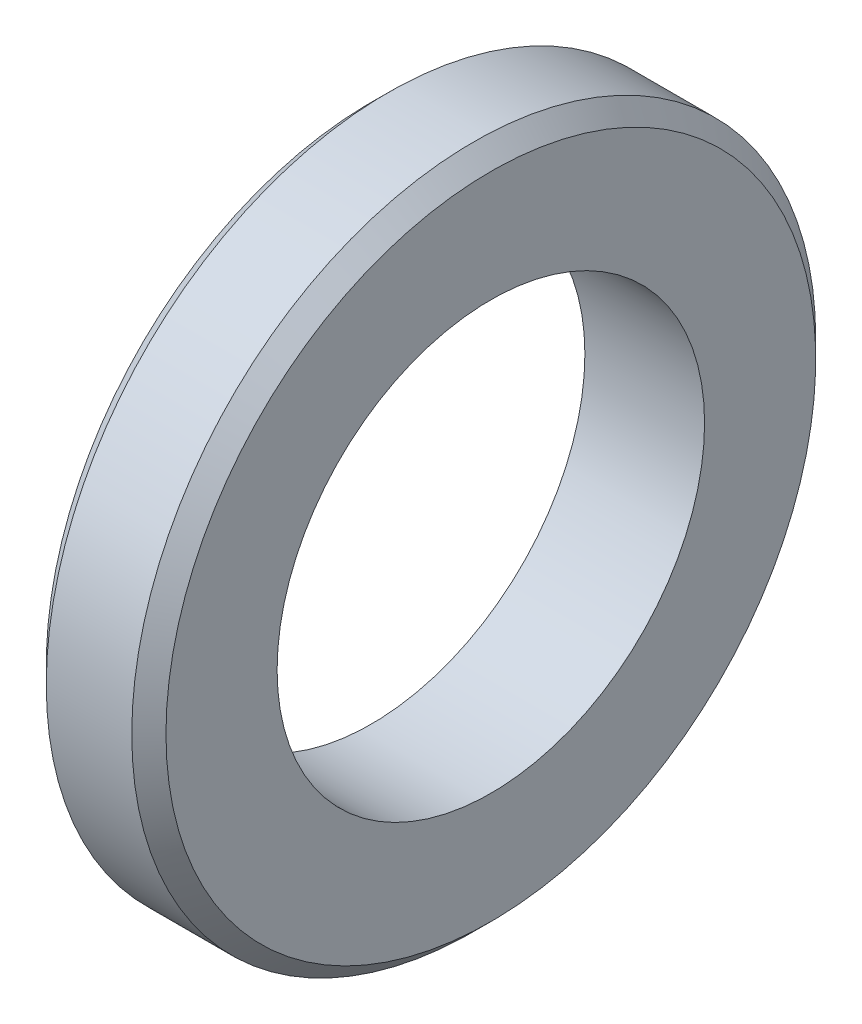
ISO-10303-21;
HEADER;
FILE_DESCRIPTION(('STEP AP214'),'2;1');
FILE_NAME('part.step','',(''),(''),'','','');
FILE_SCHEMA(('AUTOMOTIVE_DESIGN { 1 0 10303 214 1 1 1 1 }'));
ENDSEC;
DATA;
#1=APPLICATION_CONTEXT('core data for automotive mechanical design processes');
#2=APPLICATION_PROTOCOL_DEFINITION('international standard','automotive_design',2000,#1);
#3=PRODUCT_CONTEXT('',#1,'mechanical');
#4=PRODUCT('Part','Part','',(#3));
#5=PRODUCT_RELATED_PRODUCT_CATEGORY('part','',(#4));
#6=PRODUCT_DEFINITION_FORMATION('','',#4);
#7=PRODUCT_DEFINITION_CONTEXT('part definition',#1,'design');
#8=PRODUCT_DEFINITION('design','',#6,#7);
#9=PRODUCT_DEFINITION_SHAPE('','',#8);
#10=(LENGTH_UNIT() NAMED_UNIT(*) SI_UNIT(.MILLI.,.METRE.));
#11=(NAMED_UNIT(*) PLANE_ANGLE_UNIT() SI_UNIT($,.RADIAN.));
#12=(NAMED_UNIT(*) SI_UNIT($,.STERADIAN.) SOLID_ANGLE_UNIT());
#13=UNCERTAINTY_MEASURE_WITH_UNIT(LENGTH_MEASURE(1.E-05),#10,'distance_accuracy_value','');
#14=(GEOMETRIC_REPRESENTATION_CONTEXT(3) GLOBAL_UNCERTAINTY_ASSIGNED_CONTEXT((#13)) GLOBAL_UNIT_ASSIGNED_CONTEXT((#10,
#11,#12)) REPRESENTATION_CONTEXT('',''));
#15=CARTESIAN_POINT('',(0.,0.,0.));
#16=DIRECTION('',(0.,0.,1.));
#17=DIRECTION('',(1.,0.,0.));
#18=AXIS2_PLACEMENT_3D('',#15,#16,#17);
#19=CARTESIAN_POINT('',(1.4,4.,0.));
#20=DIRECTION('',(-1.,0.,0.));
#21=DIRECTION('',(0.,0.,1.));
#22=AXIS2_PLACEMENT_3D('',#19,#20,#21);
#23=PLANE('',#22);
#24=CARTESIAN_POINT('',(1.4,0.,0.));
#25=DIRECTION('',(-1.,0.,0.));
#26=DIRECTION('',(0.,0.,1.));
#27=AXIS2_PLACEMENT_3D('',#24,#25,#26);
#28=CIRCLE('',#27,3.8);
#29=CARTESIAN_POINT('',(1.4,0.,3.8));
#30=VERTEX_POINT('',#29);
#31=EDGE_CURVE('E10',#30,#30,#28,.F.);
#32=ORIENTED_EDGE('',*,*,#31,.T.);
#33=EDGE_LOOP('',(#32));
#34=FACE_BOUND('',#33,.T.);
#35=CARTESIAN_POINT('',(1.4,0.,0.));
#36=DIRECTION('',(-1.,0.,0.));
#37=DIRECTION('',(0.,0.,1.));
#38=AXIS2_PLACEMENT_3D('',#35,#36,#37);
#39=CIRCLE('',#38,2.5);
#40=CARTESIAN_POINT('',(1.4,0.,2.5));
#41=VERTEX_POINT('',#40);
#42=EDGE_CURVE('E51',#41,#41,#39,.T.);
#43=ORIENTED_EDGE('',*,*,#42,.T.);
#44=EDGE_LOOP('',(#43));
#45=FACE_BOUND('',#44,.T.);
#46=ADVANCED_FACE('F31',(#34,#45),#23,.F.);
#47=CARTESIAN_POINT('',(0.,0.,0.));
#48=DIRECTION('',(-1.,0.,0.));
#49=DIRECTION('',(0.,0.,1.));
#50=AXIS2_PLACEMENT_3D('',#47,#48,#49);
#51=CYLINDRICAL_SURFACE('',#50,2.5);
#52=ORIENTED_EDGE('',*,*,#42,.F.);
#53=EDGE_LOOP('',(#52));
#54=FACE_BOUND('',#53,.T.);
#55=CARTESIAN_POINT('',(0.,0.,0.));
#56=DIRECTION('',(-1.,0.,0.));
#57=DIRECTION('',(0.,0.,1.));
#58=AXIS2_PLACEMENT_3D('',#55,#56,#57);
#59=CIRCLE('',#58,2.5);
#60=CARTESIAN_POINT('',(0.,0.,2.5));
#61=VERTEX_POINT('',#60);
#62=EDGE_CURVE('E54',#61,#61,#59,.T.);
#63=ORIENTED_EDGE('',*,*,#62,.T.);
#64=EDGE_LOOP('',(#63));
#65=FACE_BOUND('',#64,.T.);
#66=ADVANCED_FACE('F58',(#54,#65),#51,.F.);
#67=CARTESIAN_POINT('',(0.,2.5,0.));
#68=DIRECTION('',(1.,0.,0.));
#69=DIRECTION('',(0.,0.,-1.));
#70=AXIS2_PLACEMENT_3D('',#67,#68,#69);
#71=PLANE('',#70);
#72=CARTESIAN_POINT('',(0.,0.,0.));
#73=DIRECTION('',(1.,0.,0.));
#74=DIRECTION('',(0.,0.,-1.));
#75=AXIS2_PLACEMENT_3D('',#72,#73,#74);
#76=CIRCLE('',#75,3.8);
#77=CARTESIAN_POINT('',(0.,0.,-3.8));
#78=VERTEX_POINT('',#77);
#79=EDGE_CURVE('E46',#78,#78,#76,.F.);
#80=ORIENTED_EDGE('',*,*,#79,.T.);
#81=EDGE_LOOP('',(#80));
#82=FACE_BOUND('',#81,.T.);
#83=ORIENTED_EDGE('',*,*,#62,.F.);
#84=EDGE_LOOP('',(#83));
#85=FACE_BOUND('',#84,.T.);
#86=ADVANCED_FACE('F60',(#82,#85),#71,.F.);
#87=CARTESIAN_POINT('',(0.,0.,0.));
#88=DIRECTION('',(-1.,0.,0.));
#89=DIRECTION('',(0.,0.,1.));
#90=AXIS2_PLACEMENT_3D('',#87,#88,#89);
#91=CYLINDRICAL_SURFACE('',#90,4.);
#92=CARTESIAN_POINT('',(0.200000000000002,0.,0.));
#93=DIRECTION('',(1.,0.,0.));
#94=DIRECTION('',(0.,0.,-1.));
#95=AXIS2_PLACEMENT_3D('',#92,#93,#94);
#96=CIRCLE('',#95,4.);
#97=CARTESIAN_POINT('',(0.200000000000002,0.,-4.));
#98=VERTEX_POINT('',#97);
#99=EDGE_CURVE('E38',#98,#98,#96,.T.);
#100=ORIENTED_EDGE('',*,*,#99,.T.);
#101=EDGE_LOOP('',(#100));
#102=FACE_BOUND('',#101,.T.);
#103=CARTESIAN_POINT('',(1.2,0.,0.));
#104=DIRECTION('',(-1.,0.,0.));
#105=DIRECTION('',(0.,0.,1.));
#106=AXIS2_PLACEMENT_3D('',#103,#104,#105);
#107=CIRCLE('',#106,4.);
#108=CARTESIAN_POINT('',(1.2,0.,4.));
#109=VERTEX_POINT('',#108);
#110=EDGE_CURVE('E42',#109,#109,#107,.T.);
#111=ORIENTED_EDGE('',*,*,#110,.T.);
#112=EDGE_LOOP('',(#111));
#113=FACE_BOUND('',#112,.T.);
#114=ADVANCED_FACE('F62',(#102,#113),#91,.T.);
#115=CARTESIAN_POINT('',(0.,0.,0.));
#116=DIRECTION('',(1.,0.,0.));
#117=DIRECTION('',(0.,0.,-1.));
#118=AXIS2_PLACEMENT_3D('',#115,#116,#117);
#119=CONICAL_SURFACE('',#118,3.8,0.785398163397448);
#120=ORIENTED_EDGE('',*,*,#99,.F.);
#121=EDGE_LOOP('',(#120));
#122=FACE_BOUND('',#121,.T.);
#123=ORIENTED_EDGE('',*,*,#79,.F.);
#124=EDGE_LOOP('',(#123));
#125=FACE_BOUND('',#124,.T.);
#126=ADVANCED_FACE('F69',(#122,#125),#119,.T.);
#127=CARTESIAN_POINT('',(1.2,0.,0.));
#128=DIRECTION('',(-1.,0.,0.));
#129=DIRECTION('',(0.,0.,1.));
#130=AXIS2_PLACEMENT_3D('',#127,#128,#129);
#131=CONICAL_SURFACE('',#130,4.,0.785398163397453);
#132=ORIENTED_EDGE('',*,*,#31,.F.);
#133=EDGE_LOOP('',(#132));
#134=FACE_BOUND('',#133,.T.);
#135=ORIENTED_EDGE('',*,*,#110,.F.);
#136=EDGE_LOOP('',(#135));
#137=FACE_BOUND('',#136,.T.);
#138=ADVANCED_FACE('F33',(#134,#137),#131,.T.);
#139=CLOSED_SHELL('',(#46,#66,#86,#114,#126,#138));
#140=MANIFOLD_SOLID_BREP('B2',#139);
#141=ADVANCED_BREP_SHAPE_REPRESENTATION('',(#18,#140),#14);
#142=SHAPE_DEFINITION_REPRESENTATION(#9,#141);
ENDSEC;
END-ISO-10303-21;
